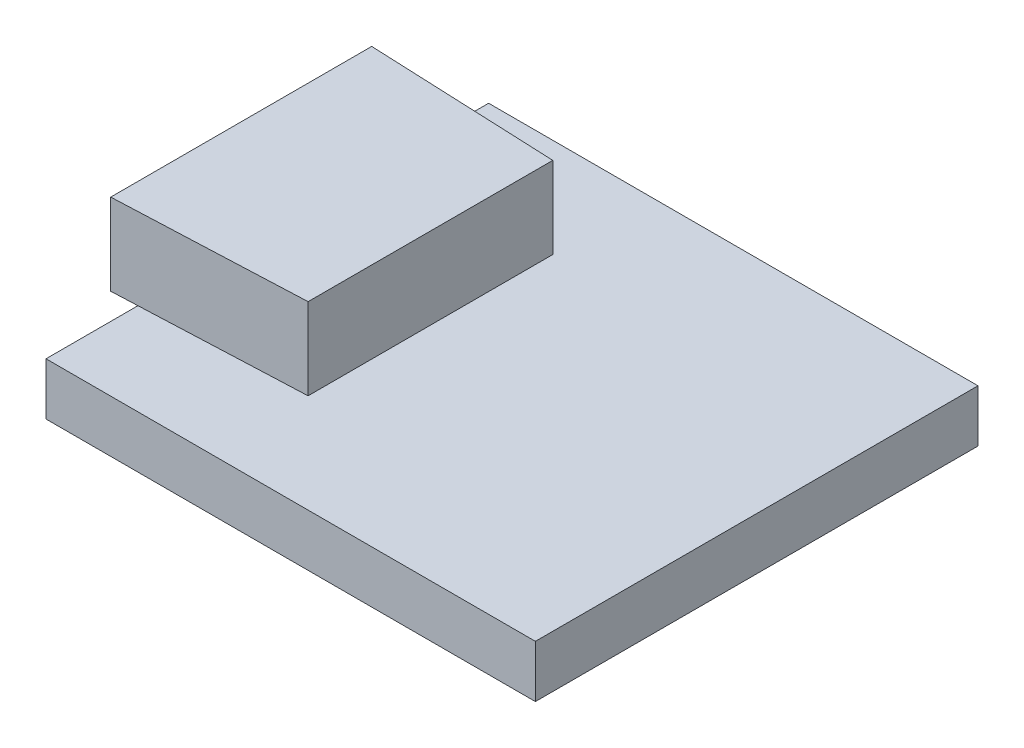
ISO-10303-21;
HEADER;
FILE_DESCRIPTION(('STEP AP214'),'2;1');
FILE_NAME('part.step','',(''),(''),'','','');
FILE_SCHEMA(('AUTOMOTIVE_DESIGN { 1 0 10303 214 1 1 1 1 }'));
ENDSEC;
DATA;
#1=APPLICATION_CONTEXT('core data for automotive mechanical design processes');
#2=APPLICATION_PROTOCOL_DEFINITION('international standard','automotive_design',2000,#1);
#3=PRODUCT_CONTEXT('',#1,'mechanical');
#4=PRODUCT('Part','Part','',(#3));
#5=PRODUCT_RELATED_PRODUCT_CATEGORY('part','',(#4));
#6=PRODUCT_DEFINITION_FORMATION('','',#4);
#7=PRODUCT_DEFINITION_CONTEXT('part definition',#1,'design');
#8=PRODUCT_DEFINITION('design','',#6,#7);
#9=PRODUCT_DEFINITION_SHAPE('','',#8);
#10=(LENGTH_UNIT() NAMED_UNIT(*) SI_UNIT(.MILLI.,.METRE.));
#11=(NAMED_UNIT(*) PLANE_ANGLE_UNIT() SI_UNIT($,.RADIAN.));
#12=(NAMED_UNIT(*) SI_UNIT($,.STERADIAN.) SOLID_ANGLE_UNIT());
#13=UNCERTAINTY_MEASURE_WITH_UNIT(LENGTH_MEASURE(1.E-05),#10,'distance_accuracy_value','');
#14=(GEOMETRIC_REPRESENTATION_CONTEXT(3) GLOBAL_UNCERTAINTY_ASSIGNED_CONTEXT((#13)) GLOBAL_UNIT_ASSIGNED_CONTEXT((#10,
#11,#12)) REPRESENTATION_CONTEXT('',''));
#15=CARTESIAN_POINT('',(0.,0.,0.));
#16=DIRECTION('',(0.,0.,1.));
#17=DIRECTION('',(1.,0.,0.));
#18=AXIS2_PLACEMENT_3D('',#15,#16,#17);
#19=CARTESIAN_POINT('',(0.,1.6,0.));
#20=DIRECTION('',(0.,-1.,0.));
#21=DIRECTION('',(0.,0.,-1.));
#22=AXIS2_PLACEMENT_3D('',#19,#20,#21);
#23=PLANE('',#22);
#24=DIRECTION('',(-0.999072338804766,0.,-0.0430634628795157));
#25=VECTOR('',#24,1.);
#26=CARTESIAN_POINT('',(-8.3,1.6,-4.));
#27=LINE('',#26,#25);
#28=CARTESIAN_POINT('',(-2.5,1.6,-3.75));
#29=VERTEX_POINT('',#28);
#30=CARTESIAN_POINT('',(-7.5,1.6,-3.96551724137931));
#31=VERTEX_POINT('',#30);
#32=EDGE_CURVE('E52',#29,#31,#27,.T.);
#33=ORIENTED_EDGE('',*,*,#32,.F.);
#34=DIRECTION('',(0.,0.,-1.));
#35=VECTOR('',#34,1.);
#36=CARTESIAN_POINT('',(-2.5,1.6,-3.75));
#37=LINE('',#36,#35);
#38=CARTESIAN_POINT('',(-2.5,1.6,3.75));
#39=VERTEX_POINT('',#38);
#40=EDGE_CURVE('E125',#39,#29,#37,.T.);
#41=ORIENTED_EDGE('',*,*,#40,.F.);
#42=DIRECTION('',(0.999072338804766,0.,-0.0430634628795159));
#43=VECTOR('',#42,1.);
#44=CARTESIAN_POINT('',(-8.3,1.6,4.));
#45=LINE('',#44,#43);
#46=CARTESIAN_POINT('',(-7.5,1.6,3.96551724137931));
#47=VERTEX_POINT('',#46);
#48=EDGE_CURVE('E11',#47,#39,#45,.T.);
#49=ORIENTED_EDGE('',*,*,#48,.F.);
#50=DIRECTION('',(0.,0.,1.));
#51=VECTOR('',#50,1.);
#52=CARTESIAN_POINT('',(-7.5,1.6,6.78333333333333));
#53=LINE('',#52,#51);
#54=CARTESIAN_POINT('',(-7.5,1.6,6.78333333333333));
#55=VERTEX_POINT('',#54);
#56=EDGE_CURVE('E146',#47,#55,#53,.T.);
#57=ORIENTED_EDGE('',*,*,#56,.T.);
#58=DIRECTION('',(1.,0.,0.));
#59=VECTOR('',#58,1.);
#60=CARTESIAN_POINT('',(-7.5,1.6,6.78333333333333));
#61=LINE('',#60,#59);
#62=CARTESIAN_POINT('',(7.5,1.6,6.78333333333333));
#63=VERTEX_POINT('',#62);
#64=EDGE_CURVE('E149',#55,#63,#61,.T.);
#65=ORIENTED_EDGE('',*,*,#64,.T.);
#66=DIRECTION('',(0.,0.,-1.));
#67=VECTOR('',#66,1.);
#68=CARTESIAN_POINT('',(7.5,1.6,6.78333333333333));
#69=LINE('',#68,#67);
#70=CARTESIAN_POINT('',(7.5,1.6,-6.78333333333333));
#71=VERTEX_POINT('',#70);
#72=EDGE_CURVE('E140',#63,#71,#69,.T.);
#73=ORIENTED_EDGE('',*,*,#72,.T.);
#74=DIRECTION('',(-1.,0.,0.));
#75=VECTOR('',#74,1.);
#76=CARTESIAN_POINT('',(-7.5,1.6,-6.78333333333333));
#77=LINE('',#76,#75);
#78=CARTESIAN_POINT('',(-7.5,1.6,-6.78333333333333));
#79=VERTEX_POINT('',#78);
#80=EDGE_CURVE('E143',#71,#79,#77,.T.);
#81=ORIENTED_EDGE('',*,*,#80,.T.);
#82=EDGE_CURVE('E147',#79,#31,#53,.T.);
#83=ORIENTED_EDGE('',*,*,#82,.T.);
#84=EDGE_LOOP('',(#33,#41,#49,#57,#65,#73,#81,#83));
#85=FACE_BOUND('',#84,.T.);
#86=ADVANCED_FACE('F35',(#85),#23,.F.);
#87=CARTESIAN_POINT('',(7.5,1.6,6.78333333333333));
#88=DIRECTION('',(-1.,0.,0.));
#89=DIRECTION('',(0.,0.,1.));
#90=AXIS2_PLACEMENT_3D('',#87,#88,#89);
#91=PLANE('',#90);
#92=DIRECTION('',(0.,0.,-1.));
#93=VECTOR('',#92,1.);
#94=CARTESIAN_POINT('',(7.5,0.,6.78333333333333));
#95=LINE('',#94,#93);
#96=CARTESIAN_POINT('',(7.5,0.,6.78333333333333));
#97=VERTEX_POINT('',#96);
#98=CARTESIAN_POINT('',(7.5,0.,-6.78333333333333));
#99=VERTEX_POINT('',#98);
#100=EDGE_CURVE('E131',#97,#99,#95,.T.);
#101=ORIENTED_EDGE('',*,*,#100,.T.);
#102=DIRECTION('',(0.,-1.,0.));
#103=VECTOR('',#102,1.);
#104=CARTESIAN_POINT('',(7.5,1.6,-6.78333333333333));
#105=LINE('',#104,#103);
#106=EDGE_CURVE('E39',#71,#99,#105,.T.);
#107=ORIENTED_EDGE('',*,*,#106,.F.);
#108=ORIENTED_EDGE('',*,*,#72,.F.);
#109=DIRECTION('',(0.,-1.,0.));
#110=VECTOR('',#109,1.);
#111=CARTESIAN_POINT('',(7.5,1.6,6.78333333333333));
#112=LINE('',#111,#110);
#113=EDGE_CURVE('E151',#63,#97,#112,.T.);
#114=ORIENTED_EDGE('',*,*,#113,.T.);
#115=EDGE_LOOP('',(#101,#107,#108,#114));
#116=FACE_BOUND('',#115,.T.);
#117=ADVANCED_FACE('F37',(#116),#91,.F.);
#118=CARTESIAN_POINT('',(-7.5,1.6,-6.78333333333333));
#119=DIRECTION('',(0.,0.,1.));
#120=DIRECTION('',(1.,0.,0.));
#121=AXIS2_PLACEMENT_3D('',#118,#119,#120);
#122=PLANE('',#121);
#123=DIRECTION('',(-1.,0.,0.));
#124=VECTOR('',#123,1.);
#125=CARTESIAN_POINT('',(-7.5,0.,-6.78333333333333));
#126=LINE('',#125,#124);
#127=CARTESIAN_POINT('',(-7.5,0.,-6.78333333333333));
#128=VERTEX_POINT('',#127);
#129=EDGE_CURVE('E134',#99,#128,#126,.T.);
#130=ORIENTED_EDGE('',*,*,#129,.T.);
#131=DIRECTION('',(0.,-1.,0.));
#132=VECTOR('',#131,1.);
#133=CARTESIAN_POINT('',(-7.5,1.6,-6.78333333333333));
#134=LINE('',#133,#132);
#135=EDGE_CURVE('E161',#79,#128,#134,.T.);
#136=ORIENTED_EDGE('',*,*,#135,.F.);
#137=ORIENTED_EDGE('',*,*,#80,.F.);
#138=ORIENTED_EDGE('',*,*,#106,.T.);
#139=EDGE_LOOP('',(#130,#136,#137,#138));
#140=FACE_BOUND('',#139,.T.);
#141=ADVANCED_FACE('F170',(#140),#122,.F.);
#142=CARTESIAN_POINT('',(-7.5,1.6,6.78333333333333));
#143=DIRECTION('',(1.,0.,0.));
#144=DIRECTION('',(0.,0.,-1.));
#145=AXIS2_PLACEMENT_3D('',#142,#143,#144);
#146=PLANE('',#145);
#147=DIRECTION('',(0.,0.,1.));
#148=VECTOR('',#147,1.);
#149=CARTESIAN_POINT('',(-7.5,0.,6.78333333333333));
#150=LINE('',#149,#148);
#151=CARTESIAN_POINT('',(-7.5,0.,6.78333333333333));
#152=VERTEX_POINT('',#151);
#153=EDGE_CURVE('E154',#128,#152,#150,.T.);
#154=ORIENTED_EDGE('',*,*,#153,.T.);
#155=DIRECTION('',(0.,-1.,0.));
#156=VECTOR('',#155,1.);
#157=CARTESIAN_POINT('',(-7.5,1.6,6.78333333333333));
#158=LINE('',#157,#156);
#159=EDGE_CURVE('E159',#55,#152,#158,.T.);
#160=ORIENTED_EDGE('',*,*,#159,.F.);
#161=ORIENTED_EDGE('',*,*,#56,.F.);
#162=EDGE_CURVE('E150',#31,#47,#53,.T.);
#163=ORIENTED_EDGE('',*,*,#162,.F.);
#164=ORIENTED_EDGE('',*,*,#82,.F.);
#165=ORIENTED_EDGE('',*,*,#135,.T.);
#166=EDGE_LOOP('',(#154,#160,#161,#163,#164,#165));
#167=FACE_BOUND('',#166,.T.);
#168=ADVANCED_FACE('F179',(#167),#146,.F.);
#169=CARTESIAN_POINT('',(-7.5,1.6,6.78333333333333));
#170=DIRECTION('',(0.,0.,-1.));
#171=DIRECTION('',(-1.,0.,0.));
#172=AXIS2_PLACEMENT_3D('',#169,#170,#171);
#173=PLANE('',#172);
#174=DIRECTION('',(1.,0.,0.));
#175=VECTOR('',#174,1.);
#176=CARTESIAN_POINT('',(-7.5,0.,6.78333333333333));
#177=LINE('',#176,#175);
#178=EDGE_CURVE('E144',#152,#97,#177,.T.);
#179=ORIENTED_EDGE('',*,*,#178,.T.);
#180=ORIENTED_EDGE('',*,*,#113,.F.);
#181=ORIENTED_EDGE('',*,*,#64,.F.);
#182=ORIENTED_EDGE('',*,*,#159,.T.);
#183=EDGE_LOOP('',(#179,#180,#181,#182));
#184=FACE_BOUND('',#183,.T.);
#185=ADVANCED_FACE('F182',(#184),#173,.F.);
#186=CARTESIAN_POINT('',(0.,0.,0.));
#187=DIRECTION('',(0.,-1.,0.));
#188=DIRECTION('',(0.,0.,-1.));
#189=AXIS2_PLACEMENT_3D('',#186,#187,#188);
#190=PLANE('',#189);
#191=ORIENTED_EDGE('',*,*,#100,.F.);
#192=ORIENTED_EDGE('',*,*,#178,.F.);
#193=ORIENTED_EDGE('',*,*,#153,.F.);
#194=ORIENTED_EDGE('',*,*,#129,.F.);
#195=EDGE_LOOP('',(#191,#192,#193,#194));
#196=FACE_BOUND('',#195,.T.);
#197=ADVANCED_FACE('F177',(#196),#190,.T.);
#198=CARTESIAN_POINT('',(-8.3,4.1,-4.));
#199=DIRECTION('',(-0.0430634628795157,0.,0.999072338804766));
#200=DIRECTION('',(0.999072338804766,0.,0.0430634628795157));
#201=AXIS2_PLACEMENT_3D('',#198,#199,#200);
#202=PLANE('',#201);
#203=ORIENTED_EDGE('',*,*,#32,.T.);
#204=CARTESIAN_POINT('',(-8.3,1.6,-4.));
#205=VERTEX_POINT('',#204);
#206=EDGE_CURVE('E129',#31,#205,#27,.T.);
#207=ORIENTED_EDGE('',*,*,#206,.T.);
#208=DIRECTION('',(0.,-1.,0.));
#209=VECTOR('',#208,1.);
#210=CARTESIAN_POINT('',(-8.3,4.1,-4.));
#211=LINE('',#210,#209);
#212=CARTESIAN_POINT('',(-8.3,4.1,-4.));
#213=VERTEX_POINT('',#212);
#214=EDGE_CURVE('E110',#213,#205,#211,.T.);
#215=ORIENTED_EDGE('',*,*,#214,.F.);
#216=DIRECTION('',(-0.999072338804766,0.,-0.0430634628795157));
#217=VECTOR('',#216,1.);
#218=CARTESIAN_POINT('',(-8.3,4.1,-4.));
#219=LINE('',#218,#217);
#220=CARTESIAN_POINT('',(-2.5,4.1,-3.75));
#221=VERTEX_POINT('',#220);
#222=EDGE_CURVE('E116',#221,#213,#219,.T.);
#223=ORIENTED_EDGE('',*,*,#222,.F.);
#224=DIRECTION('',(0.,-1.,0.));
#225=VECTOR('',#224,1.);
#226=CARTESIAN_POINT('',(-2.5,4.1,-3.75));
#227=LINE('',#226,#225);
#228=EDGE_CURVE('E197',#221,#29,#227,.T.);
#229=ORIENTED_EDGE('',*,*,#228,.T.);
#230=EDGE_LOOP('',(#203,#207,#215,#223,#229));
#231=FACE_BOUND('',#230,.T.);
#232=ADVANCED_FACE('F127',(#231),#202,.F.);
#233=CARTESIAN_POINT('',(-8.3,4.1,4.));
#234=DIRECTION('',(1.,0.,0.));
#235=DIRECTION('',(0.,0.,-1.));
#236=AXIS2_PLACEMENT_3D('',#233,#234,#235);
#237=PLANE('',#236);
#238=DIRECTION('',(0.,0.,1.));
#239=VECTOR('',#238,1.);
#240=CARTESIAN_POINT('',(-8.3,1.6,4.));
#241=LINE('',#240,#239);
#242=CARTESIAN_POINT('',(-8.3,1.6,4.));
#243=VERTEX_POINT('',#242);
#244=EDGE_CURVE('E192',#205,#243,#241,.T.);
#245=ORIENTED_EDGE('',*,*,#244,.T.);
#246=DIRECTION('',(0.,-1.,0.));
#247=VECTOR('',#246,1.);
#248=CARTESIAN_POINT('',(-8.3,4.1,4.));
#249=LINE('',#248,#247);
#250=CARTESIAN_POINT('',(-8.3,4.1,4.));
#251=VERTEX_POINT('',#250);
#252=EDGE_CURVE('E112',#251,#243,#249,.T.);
#253=ORIENTED_EDGE('',*,*,#252,.F.);
#254=DIRECTION('',(0.,0.,1.));
#255=VECTOR('',#254,1.);
#256=CARTESIAN_POINT('',(-8.3,4.1,4.));
#257=LINE('',#256,#255);
#258=EDGE_CURVE('E106',#213,#251,#257,.T.);
#259=ORIENTED_EDGE('',*,*,#258,.F.);
#260=ORIENTED_EDGE('',*,*,#214,.T.);
#261=EDGE_LOOP('',(#245,#253,#259,#260));
#262=FACE_BOUND('',#261,.T.);
#263=ADVANCED_FACE('F108',(#262),#237,.F.);
#264=CARTESIAN_POINT('',(-8.3,4.1,4.));
#265=DIRECTION('',(-0.0430634628795159,0.,-0.999072338804766));
#266=DIRECTION('',(-0.999072338804766,0.,0.0430634628795159));
#267=AXIS2_PLACEMENT_3D('',#264,#265,#266);
#268=PLANE('',#267);
#269=EDGE_CURVE('E45',#243,#47,#45,.T.);
#270=ORIENTED_EDGE('',*,*,#269,.T.);
#271=ORIENTED_EDGE('',*,*,#48,.T.);
#272=DIRECTION('',(0.,-1.,0.));
#273=VECTOR('',#272,1.);
#274=CARTESIAN_POINT('',(-2.5,4.1,3.75));
#275=LINE('',#274,#273);
#276=CARTESIAN_POINT('',(-2.5,4.1,3.75));
#277=VERTEX_POINT('',#276);
#278=EDGE_CURVE('E136',#277,#39,#275,.T.);
#279=ORIENTED_EDGE('',*,*,#278,.F.);
#280=DIRECTION('',(0.999072338804766,0.,-0.0430634628795159));
#281=VECTOR('',#280,1.);
#282=CARTESIAN_POINT('',(-8.3,4.1,4.));
#283=LINE('',#282,#281);
#284=EDGE_CURVE('E115',#251,#277,#283,.T.);
#285=ORIENTED_EDGE('',*,*,#284,.F.);
#286=ORIENTED_EDGE('',*,*,#252,.T.);
#287=EDGE_LOOP('',(#270,#271,#279,#285,#286));
#288=FACE_BOUND('',#287,.T.);
#289=ADVANCED_FACE('F189',(#288),#268,.F.);
#290=CARTESIAN_POINT('',(-2.5,4.1,-3.75));
#291=DIRECTION('',(-1.,0.,0.));
#292=DIRECTION('',(0.,0.,1.));
#293=AXIS2_PLACEMENT_3D('',#290,#291,#292);
#294=PLANE('',#293);
#295=ORIENTED_EDGE('',*,*,#40,.T.);
#296=ORIENTED_EDGE('',*,*,#228,.F.);
#297=DIRECTION('',(0.,0.,-1.));
#298=VECTOR('',#297,1.);
#299=CARTESIAN_POINT('',(-2.5,4.1,-3.75));
#300=LINE('',#299,#298);
#301=EDGE_CURVE('E121',#277,#221,#300,.T.);
#302=ORIENTED_EDGE('',*,*,#301,.F.);
#303=ORIENTED_EDGE('',*,*,#278,.T.);
#304=EDGE_LOOP('',(#295,#296,#302,#303));
#305=FACE_BOUND('',#304,.T.);
#306=ADVANCED_FACE('F199',(#305),#294,.F.);
#307=CARTESIAN_POINT('',(0.,4.1,0.));
#308=DIRECTION('',(0.,-1.,0.));
#309=DIRECTION('',(0.,0.,-1.));
#310=AXIS2_PLACEMENT_3D('',#307,#308,#309);
#311=PLANE('',#310);
#312=ORIENTED_EDGE('',*,*,#222,.T.);
#313=ORIENTED_EDGE('',*,*,#258,.T.);
#314=ORIENTED_EDGE('',*,*,#284,.T.);
#315=ORIENTED_EDGE('',*,*,#301,.T.);
#316=EDGE_LOOP('',(#312,#313,#314,#315));
#317=FACE_BOUND('',#316,.T.);
#318=ADVANCED_FACE('F119',(#317),#311,.F.);
#319=CARTESIAN_POINT('',(0.,1.6,0.));
#320=DIRECTION('',(0.,-1.,0.));
#321=DIRECTION('',(0.,0.,-1.));
#322=AXIS2_PLACEMENT_3D('',#319,#320,#321);
#323=PLANE('',#322);
#324=ORIENTED_EDGE('',*,*,#206,.F.);
#325=ORIENTED_EDGE('',*,*,#162,.T.);
#326=ORIENTED_EDGE('',*,*,#269,.F.);
#327=ORIENTED_EDGE('',*,*,#244,.F.);
#328=EDGE_LOOP('',(#324,#325,#326,#327));
#329=FACE_BOUND('',#328,.T.);
#330=ADVANCED_FACE('F187',(#329),#323,.T.);
#331=CLOSED_SHELL('',(#86,#117,#141,#168,#185,#197,#232,#263,#289,#306,#318,#330));
#332=MANIFOLD_SOLID_BREP('B2',#331);
#333=ADVANCED_BREP_SHAPE_REPRESENTATION('',(#18,#332),#14);
#334=SHAPE_DEFINITION_REPRESENTATION(#9,#333);
ENDSEC;
END-ISO-10303-21;
